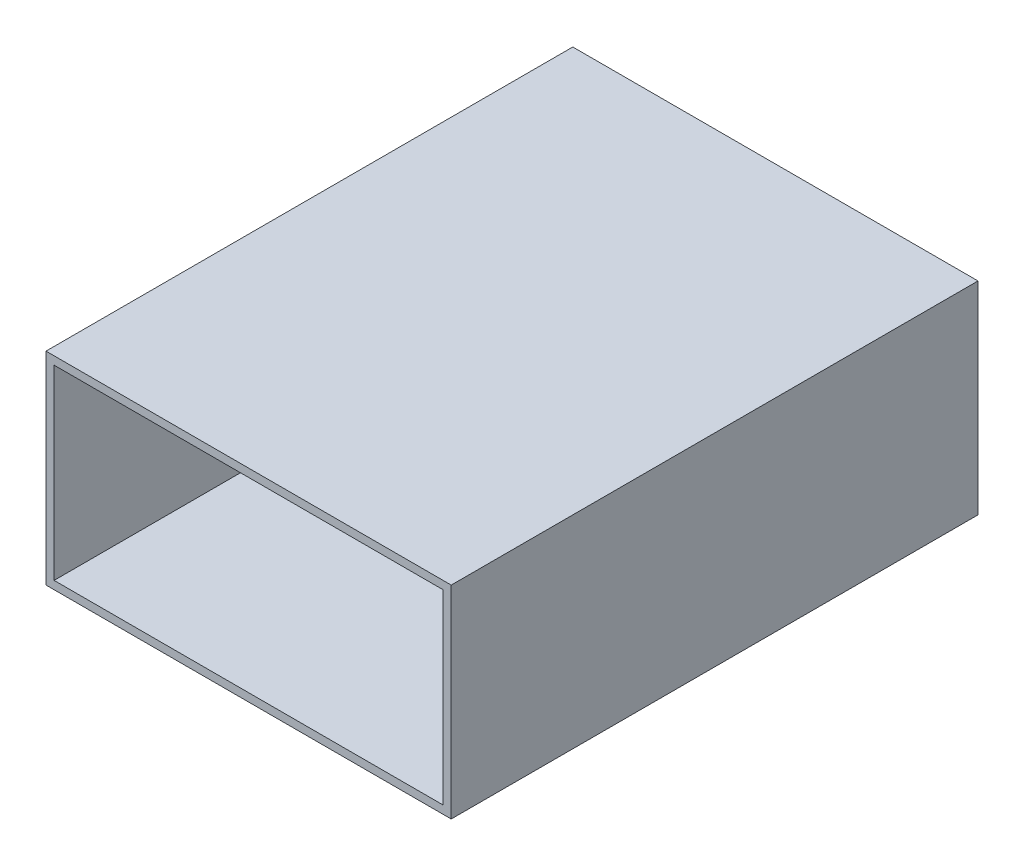
ISO-10303-21;
HEADER;
FILE_DESCRIPTION(('STEP AP214'),'2;1');
FILE_NAME('part.step','',(''),(''),'','','');
FILE_SCHEMA(('AUTOMOTIVE_DESIGN { 1 0 10303 214 1 1 1 1 }'));
ENDSEC;
DATA;
#1=APPLICATION_CONTEXT('core data for automotive mechanical design processes');
#2=APPLICATION_PROTOCOL_DEFINITION('international standard','automotive_design',2000,#1);
#3=PRODUCT_CONTEXT('',#1,'mechanical');
#4=PRODUCT('Part','Part','',(#3));
#5=PRODUCT_RELATED_PRODUCT_CATEGORY('part','',(#4));
#6=PRODUCT_DEFINITION_FORMATION('','',#4);
#7=PRODUCT_DEFINITION_CONTEXT('part definition',#1,'design');
#8=PRODUCT_DEFINITION('design','',#6,#7);
#9=PRODUCT_DEFINITION_SHAPE('','',#8);
#10=(LENGTH_UNIT() NAMED_UNIT(*) SI_UNIT(.MILLI.,.METRE.));
#11=(NAMED_UNIT(*) PLANE_ANGLE_UNIT() SI_UNIT($,.RADIAN.));
#12=(NAMED_UNIT(*) SI_UNIT($,.STERADIAN.) SOLID_ANGLE_UNIT());
#13=UNCERTAINTY_MEASURE_WITH_UNIT(LENGTH_MEASURE(1.E-05),#10,'distance_accuracy_value','');
#14=(GEOMETRIC_REPRESENTATION_CONTEXT(3) GLOBAL_UNCERTAINTY_ASSIGNED_CONTEXT((#13)) GLOBAL_UNIT_ASSIGNED_CONTEXT((#10,
#11,#12)) REPRESENTATION_CONTEXT('',''));
#15=CARTESIAN_POINT('',(0.,0.,0.));
#16=DIRECTION('',(0.,0.,1.));
#17=DIRECTION('',(1.,0.,0.));
#18=AXIS2_PLACEMENT_3D('',#15,#16,#17);
#19=CARTESIAN_POINT('',(0.,0.,65.));
#20=DIRECTION('',(0.,0.,-1.));
#21=DIRECTION('',(-1.,0.,0.));
#22=AXIS2_PLACEMENT_3D('',#19,#20,#21);
#23=PLANE('',#22);
#24=DIRECTION('',(0.,1.,0.));
#25=VECTOR('',#24,1.);
#26=CARTESIAN_POINT('',(25.,-12.5,65.));
#27=LINE('',#26,#25);
#28=CARTESIAN_POINT('',(25.,-12.5,65.));
#29=VERTEX_POINT('',#28);
#30=CARTESIAN_POINT('',(25.,12.5,65.));
#31=VERTEX_POINT('',#30);
#32=EDGE_CURVE('E137',#29,#31,#27,.T.);
#33=ORIENTED_EDGE('',*,*,#32,.T.);
#34=DIRECTION('',(-1.,0.,0.));
#35=VECTOR('',#34,1.);
#36=CARTESIAN_POINT('',(-25.,12.5,65.));
#37=LINE('',#36,#35);
#38=CARTESIAN_POINT('',(-25.,12.5,65.));
#39=VERTEX_POINT('',#38);
#40=EDGE_CURVE('E140',#31,#39,#37,.T.);
#41=ORIENTED_EDGE('',*,*,#40,.T.);
#42=DIRECTION('',(0.,-1.,0.));
#43=VECTOR('',#42,1.);
#44=CARTESIAN_POINT('',(-25.,-12.5,65.));
#45=LINE('',#44,#43);
#46=CARTESIAN_POINT('',(-25.,-12.5,65.));
#47=VERTEX_POINT('',#46);
#48=EDGE_CURVE('E143',#39,#47,#45,.T.);
#49=ORIENTED_EDGE('',*,*,#48,.T.);
#50=DIRECTION('',(1.,0.,0.));
#51=VECTOR('',#50,1.);
#52=CARTESIAN_POINT('',(-25.,-12.5,65.));
#53=LINE('',#52,#51);
#54=EDGE_CURVE('E145',#47,#29,#53,.T.);
#55=ORIENTED_EDGE('',*,*,#54,.T.);
#56=EDGE_LOOP('',(#33,#41,#49,#55));
#57=FACE_BOUND('',#56,.T.);
#58=DIRECTION('',(0.,-1.,0.));
#59=VECTOR('',#58,1.);
#60=CARTESIAN_POINT('',(-24.,-11.5,65.));
#61=LINE('',#60,#59);
#62=CARTESIAN_POINT('',(-24.,11.5,65.));
#63=VERTEX_POINT('',#62);
#64=CARTESIAN_POINT('',(-24.,-11.5,65.));
#65=VERTEX_POINT('',#64);
#66=EDGE_CURVE('E101',#63,#65,#61,.T.);
#67=ORIENTED_EDGE('',*,*,#66,.F.);
#68=DIRECTION('',(-1.,0.,0.));
#69=VECTOR('',#68,1.);
#70=CARTESIAN_POINT('',(-24.,11.5,65.));
#71=LINE('',#70,#69);
#72=CARTESIAN_POINT('',(24.,11.5,65.));
#73=VERTEX_POINT('',#72);
#74=EDGE_CURVE('E123',#73,#63,#71,.T.);
#75=ORIENTED_EDGE('',*,*,#74,.F.);
#76=DIRECTION('',(0.,1.,0.));
#77=VECTOR('',#76,1.);
#78=CARTESIAN_POINT('',(24.,-11.5,65.));
#79=LINE('',#78,#77);
#80=CARTESIAN_POINT('',(24.,-11.5,65.));
#81=VERTEX_POINT('',#80);
#82=EDGE_CURVE('E121',#81,#73,#79,.T.);
#83=ORIENTED_EDGE('',*,*,#82,.F.);
#84=DIRECTION('',(1.,0.,0.));
#85=VECTOR('',#84,1.);
#86=CARTESIAN_POINT('',(-24.,-11.5,65.));
#87=LINE('',#86,#85);
#88=EDGE_CURVE('E109',#65,#81,#87,.T.);
#89=ORIENTED_EDGE('',*,*,#88,.F.);
#90=EDGE_LOOP('',(#67,#75,#83,#89));
#91=FACE_BOUND('',#90,.T.);
#92=ADVANCED_FACE('F36',(#57,#91),#23,.F.);
#93=CARTESIAN_POINT('',(0.,0.,0.));
#94=DIRECTION('',(0.,0.,-1.));
#95=DIRECTION('',(-1.,0.,0.));
#96=AXIS2_PLACEMENT_3D('',#93,#94,#95);
#97=PLANE('',#96);
#98=DIRECTION('',(0.,1.,0.));
#99=VECTOR('',#98,1.);
#100=CARTESIAN_POINT('',(25.,-12.5,0.));
#101=LINE('',#100,#99);
#102=CARTESIAN_POINT('',(25.,-12.5,0.));
#103=VERTEX_POINT('',#102);
#104=CARTESIAN_POINT('',(25.,12.5,0.));
#105=VERTEX_POINT('',#104);
#106=EDGE_CURVE('E117',#103,#105,#101,.T.);
#107=ORIENTED_EDGE('',*,*,#106,.F.);
#108=DIRECTION('',(1.,0.,0.));
#109=VECTOR('',#108,1.);
#110=CARTESIAN_POINT('',(-25.,-12.5,0.));
#111=LINE('',#110,#109);
#112=CARTESIAN_POINT('',(-25.,-12.5,0.));
#113=VERTEX_POINT('',#112);
#114=EDGE_CURVE('E141',#113,#103,#111,.T.);
#115=ORIENTED_EDGE('',*,*,#114,.F.);
#116=DIRECTION('',(0.,-1.,0.));
#117=VECTOR('',#116,1.);
#118=CARTESIAN_POINT('',(-25.,-12.5,0.));
#119=LINE('',#118,#117);
#120=CARTESIAN_POINT('',(-25.,12.5,0.));
#121=VERTEX_POINT('',#120);
#122=EDGE_CURVE('E152',#121,#113,#119,.T.);
#123=ORIENTED_EDGE('',*,*,#122,.F.);
#124=DIRECTION('',(-1.,0.,0.));
#125=VECTOR('',#124,1.);
#126=CARTESIAN_POINT('',(-25.,12.5,0.));
#127=LINE('',#126,#125);
#128=EDGE_CURVE('E150',#105,#121,#127,.T.);
#129=ORIENTED_EDGE('',*,*,#128,.F.);
#130=EDGE_LOOP('',(#107,#115,#123,#129));
#131=FACE_BOUND('',#130,.T.);
#132=DIRECTION('',(-1.,0.,0.));
#133=VECTOR('',#132,1.);
#134=CARTESIAN_POINT('',(-24.,11.5,0.));
#135=LINE('',#134,#133);
#136=CARTESIAN_POINT('',(24.,11.5,0.));
#137=VERTEX_POINT('',#136);
#138=CARTESIAN_POINT('',(-24.,11.5,0.));
#139=VERTEX_POINT('',#138);
#140=EDGE_CURVE('E110',#137,#139,#135,.T.);
#141=ORIENTED_EDGE('',*,*,#140,.T.);
#142=DIRECTION('',(0.,-1.,0.));
#143=VECTOR('',#142,1.);
#144=CARTESIAN_POINT('',(-24.,-11.5,0.));
#145=LINE('',#144,#143);
#146=CARTESIAN_POINT('',(-24.,-11.5,0.));
#147=VERTEX_POINT('',#146);
#148=EDGE_CURVE('E59',#139,#147,#145,.T.);
#149=ORIENTED_EDGE('',*,*,#148,.T.);
#150=DIRECTION('',(1.,0.,0.));
#151=VECTOR('',#150,1.);
#152=CARTESIAN_POINT('',(-24.,-11.5,0.));
#153=LINE('',#152,#151);
#154=CARTESIAN_POINT('',(24.,-11.5,0.));
#155=VERTEX_POINT('',#154);
#156=EDGE_CURVE('E116',#147,#155,#153,.T.);
#157=ORIENTED_EDGE('',*,*,#156,.T.);
#158=DIRECTION('',(0.,1.,0.));
#159=VECTOR('',#158,1.);
#160=CARTESIAN_POINT('',(24.,-11.5,0.));
#161=LINE('',#160,#159);
#162=EDGE_CURVE('E129',#155,#137,#161,.T.);
#163=ORIENTED_EDGE('',*,*,#162,.T.);
#164=EDGE_LOOP('',(#141,#149,#157,#163));
#165=FACE_BOUND('',#164,.T.);
#166=ADVANCED_FACE('F170',(#131,#165),#97,.T.);
#167=CARTESIAN_POINT('',(25.,-12.5,65.));
#168=DIRECTION('',(-1.,0.,0.));
#169=DIRECTION('',(0.,0.,1.));
#170=AXIS2_PLACEMENT_3D('',#167,#168,#169);
#171=PLANE('',#170);
#172=ORIENTED_EDGE('',*,*,#106,.T.);
#173=DIRECTION('',(0.,0.,-1.));
#174=VECTOR('',#173,1.);
#175=CARTESIAN_POINT('',(25.,12.5,65.));
#176=LINE('',#175,#174);
#177=EDGE_CURVE('E11',#31,#105,#176,.T.);
#178=ORIENTED_EDGE('',*,*,#177,.F.);
#179=ORIENTED_EDGE('',*,*,#32,.F.);
#180=DIRECTION('',(0.,0.,-1.));
#181=VECTOR('',#180,1.);
#182=CARTESIAN_POINT('',(25.,-12.5,65.));
#183=LINE('',#182,#181);
#184=EDGE_CURVE('E147',#29,#103,#183,.T.);
#185=ORIENTED_EDGE('',*,*,#184,.T.);
#186=EDGE_LOOP('',(#172,#178,#179,#185));
#187=FACE_BOUND('',#186,.T.);
#188=ADVANCED_FACE('F38',(#187),#171,.F.);
#189=CARTESIAN_POINT('',(-25.,12.5,65.));
#190=DIRECTION('',(0.,-1.,0.));
#191=DIRECTION('',(0.,0.,-1.));
#192=AXIS2_PLACEMENT_3D('',#189,#190,#191);
#193=PLANE('',#192);
#194=ORIENTED_EDGE('',*,*,#128,.T.);
#195=DIRECTION('',(0.,0.,-1.));
#196=VECTOR('',#195,1.);
#197=CARTESIAN_POINT('',(-25.,12.5,65.));
#198=LINE('',#197,#196);
#199=EDGE_CURVE('E44',#39,#121,#198,.T.);
#200=ORIENTED_EDGE('',*,*,#199,.F.);
#201=ORIENTED_EDGE('',*,*,#40,.F.);
#202=ORIENTED_EDGE('',*,*,#177,.T.);
#203=EDGE_LOOP('',(#194,#200,#201,#202));
#204=FACE_BOUND('',#203,.T.);
#205=ADVANCED_FACE('F180',(#204),#193,.F.);
#206=CARTESIAN_POINT('',(-25.,-12.5,65.));
#207=DIRECTION('',(1.,0.,0.));
#208=DIRECTION('',(0.,0.,-1.));
#209=AXIS2_PLACEMENT_3D('',#206,#207,#208);
#210=PLANE('',#209);
#211=ORIENTED_EDGE('',*,*,#122,.T.);
#212=DIRECTION('',(0.,0.,-1.));
#213=VECTOR('',#212,1.);
#214=CARTESIAN_POINT('',(-25.,-12.5,65.));
#215=LINE('',#214,#213);
#216=EDGE_CURVE('E157',#47,#113,#215,.T.);
#217=ORIENTED_EDGE('',*,*,#216,.F.);
#218=ORIENTED_EDGE('',*,*,#48,.F.);
#219=ORIENTED_EDGE('',*,*,#199,.T.);
#220=EDGE_LOOP('',(#211,#217,#218,#219));
#221=FACE_BOUND('',#220,.T.);
#222=ADVANCED_FACE('F164',(#221),#210,.F.);
#223=CARTESIAN_POINT('',(-25.,-12.5,65.));
#224=DIRECTION('',(0.,1.,0.));
#225=DIRECTION('',(0.,0.,1.));
#226=AXIS2_PLACEMENT_3D('',#223,#224,#225);
#227=PLANE('',#226);
#228=ORIENTED_EDGE('',*,*,#114,.T.);
#229=ORIENTED_EDGE('',*,*,#184,.F.);
#230=ORIENTED_EDGE('',*,*,#54,.F.);
#231=ORIENTED_EDGE('',*,*,#216,.T.);
#232=EDGE_LOOP('',(#228,#229,#230,#231));
#233=FACE_BOUND('',#232,.T.);
#234=ADVANCED_FACE('F174',(#233),#227,.F.);
#235=CARTESIAN_POINT('',(-24.,-11.5,65.));
#236=DIRECTION('',(1.,0.,0.));
#237=DIRECTION('',(0.,0.,-1.));
#238=AXIS2_PLACEMENT_3D('',#235,#236,#237);
#239=PLANE('',#238);
#240=ORIENTED_EDGE('',*,*,#148,.F.);
#241=DIRECTION('',(0.,0.,-1.));
#242=VECTOR('',#241,1.);
#243=CARTESIAN_POINT('',(-24.,11.5,65.));
#244=LINE('',#243,#242);
#245=EDGE_CURVE('E105',#63,#139,#244,.T.);
#246=ORIENTED_EDGE('',*,*,#245,.F.);
#247=ORIENTED_EDGE('',*,*,#66,.T.);
#248=DIRECTION('',(0.,0.,-1.));
#249=VECTOR('',#248,1.);
#250=CARTESIAN_POINT('',(-24.,-11.5,65.));
#251=LINE('',#250,#249);
#252=EDGE_CURVE('E104',#65,#147,#251,.T.);
#253=ORIENTED_EDGE('',*,*,#252,.T.);
#254=EDGE_LOOP('',(#240,#246,#247,#253));
#255=FACE_BOUND('',#254,.T.);
#256=ADVANCED_FACE('F103',(#255),#239,.T.);
#257=CARTESIAN_POINT('',(-24.,-11.5,65.));
#258=DIRECTION('',(0.,1.,0.));
#259=DIRECTION('',(0.,0.,1.));
#260=AXIS2_PLACEMENT_3D('',#257,#258,#259);
#261=PLANE('',#260);
#262=ORIENTED_EDGE('',*,*,#156,.F.);
#263=ORIENTED_EDGE('',*,*,#252,.F.);
#264=ORIENTED_EDGE('',*,*,#88,.T.);
#265=DIRECTION('',(0.,0.,-1.));
#266=VECTOR('',#265,1.);
#267=CARTESIAN_POINT('',(24.,-11.5,65.));
#268=LINE('',#267,#266);
#269=EDGE_CURVE('E118',#81,#155,#268,.T.);
#270=ORIENTED_EDGE('',*,*,#269,.T.);
#271=EDGE_LOOP('',(#262,#263,#264,#270));
#272=FACE_BOUND('',#271,.T.);
#273=ADVANCED_FACE('F113',(#272),#261,.T.);
#274=CARTESIAN_POINT('',(24.,-11.5,65.));
#275=DIRECTION('',(-1.,0.,0.));
#276=DIRECTION('',(0.,0.,1.));
#277=AXIS2_PLACEMENT_3D('',#274,#275,#276);
#278=PLANE('',#277);
#279=ORIENTED_EDGE('',*,*,#162,.F.);
#280=ORIENTED_EDGE('',*,*,#269,.F.);
#281=ORIENTED_EDGE('',*,*,#82,.T.);
#282=DIRECTION('',(0.,0.,-1.));
#283=VECTOR('',#282,1.);
#284=CARTESIAN_POINT('',(24.,11.5,65.));
#285=LINE('',#284,#283);
#286=EDGE_CURVE('E51',#73,#137,#285,.T.);
#287=ORIENTED_EDGE('',*,*,#286,.T.);
#288=EDGE_LOOP('',(#279,#280,#281,#287));
#289=FACE_BOUND('',#288,.T.);
#290=ADVANCED_FACE('F203',(#289),#278,.T.);
#291=CARTESIAN_POINT('',(-24.,11.5,65.));
#292=DIRECTION('',(0.,-1.,0.));
#293=DIRECTION('',(0.,0.,-1.));
#294=AXIS2_PLACEMENT_3D('',#291,#292,#293);
#295=PLANE('',#294);
#296=ORIENTED_EDGE('',*,*,#140,.F.);
#297=ORIENTED_EDGE('',*,*,#286,.F.);
#298=ORIENTED_EDGE('',*,*,#74,.T.);
#299=ORIENTED_EDGE('',*,*,#245,.T.);
#300=EDGE_LOOP('',(#296,#297,#298,#299));
#301=FACE_BOUND('',#300,.T.);
#302=ADVANCED_FACE('F207',(#301),#295,.T.);
#303=CLOSED_SHELL('',(#92,#166,#188,#205,#222,#234,#256,#273,#290,#302));
#304=MANIFOLD_SOLID_BREP('B2',#303);
#305=ADVANCED_BREP_SHAPE_REPRESENTATION('',(#18,#304),#14);
#306=SHAPE_DEFINITION_REPRESENTATION(#9,#305);
ENDSEC;
END-ISO-10303-21;
